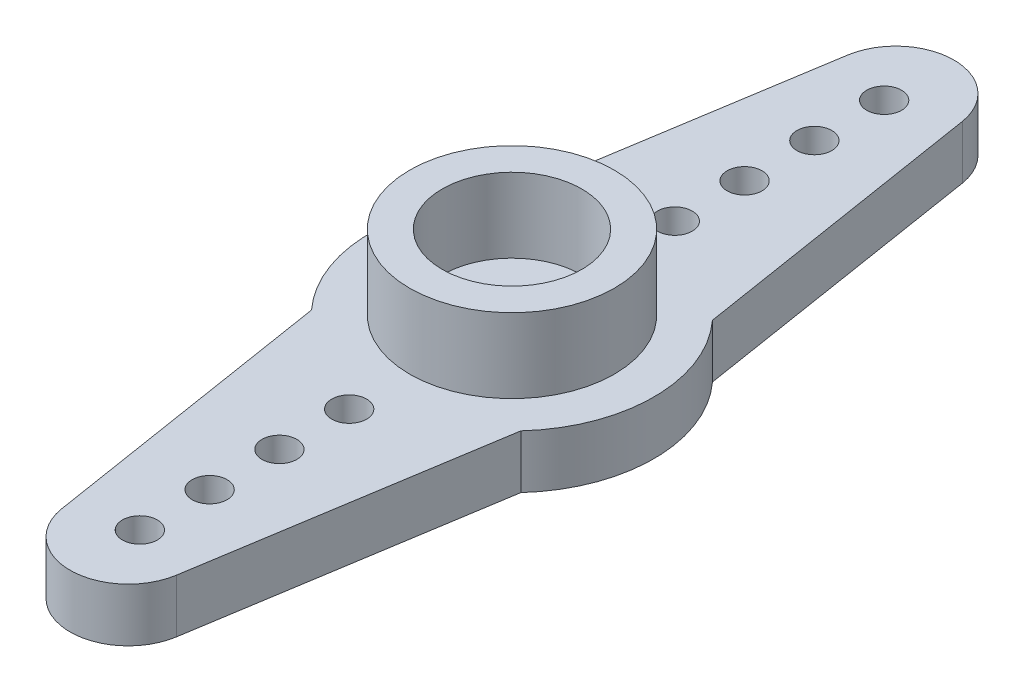
ISO-10303-21;
HEADER;
FILE_DESCRIPTION(('STEP AP214'),'2;1');
FILE_NAME('part.step','',(''),(''),'','','');
FILE_SCHEMA(('AUTOMOTIVE_DESIGN { 1 0 10303 214 1 1 1 1 }'));
ENDSEC;
DATA;
#1=APPLICATION_CONTEXT('core data for automotive mechanical design processes');
#2=APPLICATION_PROTOCOL_DEFINITION('international standard','automotive_design',2000,#1);
#3=PRODUCT_CONTEXT('',#1,'mechanical');
#4=PRODUCT('Part','Part','',(#3));
#5=PRODUCT_RELATED_PRODUCT_CATEGORY('part','',(#4));
#6=PRODUCT_DEFINITION_FORMATION('','',#4);
#7=PRODUCT_DEFINITION_CONTEXT('part definition',#1,'design');
#8=PRODUCT_DEFINITION('design','',#6,#7);
#9=PRODUCT_DEFINITION_SHAPE('','',#8);
#10=(LENGTH_UNIT() NAMED_UNIT(*) SI_UNIT(.MILLI.,.METRE.));
#11=(NAMED_UNIT(*) PLANE_ANGLE_UNIT() SI_UNIT($,.RADIAN.));
#12=(NAMED_UNIT(*) SI_UNIT($,.STERADIAN.) SOLID_ANGLE_UNIT());
#13=UNCERTAINTY_MEASURE_WITH_UNIT(LENGTH_MEASURE(1.E-05),#10,'distance_accuracy_value','');
#14=(GEOMETRIC_REPRESENTATION_CONTEXT(3) GLOBAL_UNCERTAINTY_ASSIGNED_CONTEXT((#13)) GLOBAL_UNIT_ASSIGNED_CONTEXT((#10,
#11,#12)) REPRESENTATION_CONTEXT('',''));
#15=CARTESIAN_POINT('',(0.,0.,0.));
#16=DIRECTION('',(0.,0.,1.));
#17=DIRECTION('',(1.,0.,0.));
#18=AXIS2_PLACEMENT_3D('',#15,#16,#17);
#19=CARTESIAN_POINT('',(0.,2.3,0.));
#20=DIRECTION('',(0.,-1.,0.));
#21=DIRECTION('',(0.,0.,-1.));
#22=AXIS2_PLACEMENT_3D('',#19,#20,#21);
#23=CYLINDRICAL_SURFACE('',#22,6.1);
#24=DIRECTION('',(0.,-1.,0.));
#25=VECTOR('',#24,1.);
#26=CARTESIAN_POINT('',(4.5,2.3,4.1182520563948));
#27=LINE('',#26,#25);
#28=CARTESIAN_POINT('',(4.5,2.3,4.1182520563948));
#29=VERTEX_POINT('',#28);
#30=CARTESIAN_POINT('',(4.5,0.,4.1182520563948));
#31=VERTEX_POINT('',#30);
#32=EDGE_CURVE('E123',#29,#31,#27,.T.);
#33=ORIENTED_EDGE('',*,*,#32,.T.);
#34=CARTESIAN_POINT('',(0.,0.,0.));
#35=DIRECTION('',(0.,1.,0.));
#36=DIRECTION('',(0.,0.,1.));
#37=AXIS2_PLACEMENT_3D('',#34,#35,#36);
#38=CIRCLE('',#37,6.1);
#39=CARTESIAN_POINT('',(4.5,0.,-4.1182520563948));
#40=VERTEX_POINT('',#39);
#41=EDGE_CURVE('E261',#31,#40,#38,.T.);
#42=ORIENTED_EDGE('',*,*,#41,.T.);
#43=DIRECTION('',(0.,-1.,0.));
#44=VECTOR('',#43,1.);
#45=CARTESIAN_POINT('',(4.5,2.3,-4.1182520563948));
#46=LINE('',#45,#44);
#47=CARTESIAN_POINT('',(4.5,2.3,-4.1182520563948));
#48=VERTEX_POINT('',#47);
#49=EDGE_CURVE('E231',#48,#40,#46,.T.);
#50=ORIENTED_EDGE('',*,*,#49,.F.);
#51=CARTESIAN_POINT('',(0.,2.3,0.));
#52=DIRECTION('',(0.,1.,0.));
#53=DIRECTION('',(0.,0.,1.));
#54=AXIS2_PLACEMENT_3D('',#51,#52,#53);
#55=CIRCLE('',#54,6.1);
#56=EDGE_CURVE('E59',#29,#48,#55,.T.);
#57=ORIENTED_EDGE('',*,*,#56,.F.);
#58=EDGE_LOOP('',(#33,#42,#50,#57));
#59=FACE_BOUND('',#58,.T.);
#60=ADVANCED_FACE('F41',(#59),#23,.T.);
#61=CARTESIAN_POINT('',(0.,2.3,0.));
#62=DIRECTION('',(0.,1.,0.));
#63=DIRECTION('',(0.,0.,1.));
#64=AXIS2_PLACEMENT_3D('',#61,#62,#63);
#65=PLANE('',#64);
#66=CARTESIAN_POINT('',(0.,2.3,0.));
#67=DIRECTION('',(0.,1.,0.));
#68=DIRECTION('',(0.,0.,1.));
#69=AXIS2_PLACEMENT_3D('',#66,#67,#68);
#70=CIRCLE('',#69,1.5);
#71=CARTESIAN_POINT('',(0.,2.3,1.5));
#72=VERTEX_POINT('',#71);
#73=EDGE_CURVE('E257',#72,#72,#70,.T.);
#74=ORIENTED_EDGE('',*,*,#73,.F.);
#75=EDGE_LOOP('',(#74));
#76=FACE_BOUND('',#75,.T.);
#77=CARTESIAN_POINT('',(0.,2.3,0.));
#78=DIRECTION('',(0.,1.,0.));
#79=DIRECTION('',(0.,0.,1.));
#80=AXIS2_PLACEMENT_3D('',#77,#78,#79);
#81=CIRCLE('',#80,3.);
#82=CARTESIAN_POINT('',(0.,2.3,3.));
#83=VERTEX_POINT('',#82);
#84=EDGE_CURVE('E235',#83,#83,#81,.T.);
#85=ORIENTED_EDGE('',*,*,#84,.T.);
#86=EDGE_LOOP('',(#85));
#87=FACE_BOUND('',#86,.T.);
#88=ADVANCED_FACE('F294',(#76,#87),#65,.T.);
#89=CARTESIAN_POINT('',(0.,2.3,0.));
#90=DIRECTION('',(0.,1.,0.));
#91=DIRECTION('',(0.,0.,1.));
#92=AXIS2_PLACEMENT_3D('',#89,#90,#91);
#93=CIRCLE('',#92,4.4);
#94=CARTESIAN_POINT('',(0.,2.3,4.4));
#95=VERTEX_POINT('',#94);
#96=EDGE_CURVE('E11',#95,#95,#93,.T.);
#97=ORIENTED_EDGE('',*,*,#96,.F.);
#98=EDGE_LOOP('',(#97));
#99=FACE_BOUND('',#98,.T.);
#100=CARTESIAN_POINT('',(-4.5,2.3,-4.1182520563948));
#101=VERTEX_POINT('',#100);
#102=CARTESIAN_POINT('',(-4.5,2.3,4.1182520563948));
#103=VERTEX_POINT('',#102);
#104=EDGE_CURVE('E51',#101,#103,#55,.T.);
#105=ORIENTED_EDGE('',*,*,#104,.T.);
#106=DIRECTION('',(-0.157019797021949,0.,-0.987595455307074));
#107=VECTOR('',#106,1.);
#108=CARTESIAN_POINT('',(-5.02767726414761,2.3,0.799360567392308));
#109=LINE('',#108,#107);
#110=CARTESIAN_POINT('',(-2.46898863826769,2.3,16.8925494925549));
#111=VERTEX_POINT('',#110);
#112=EDGE_CURVE('E135',#111,#103,#109,.T.);
#113=ORIENTED_EDGE('',*,*,#112,.F.);
#114=CARTESIAN_POINT('',(0.,2.3,16.5));
#115=DIRECTION('',(0.,-1.,0.));
#116=DIRECTION('',(0.,0.,1.));
#117=AXIS2_PLACEMENT_3D('',#114,#115,#116);
#118=CIRCLE('',#117,2.5);
#119=CARTESIAN_POINT('',(2.46898863826768,2.3,16.8925494925549));
#120=VERTEX_POINT('',#119);
#121=EDGE_CURVE('E114',#120,#111,#118,.T.);
#122=ORIENTED_EDGE('',*,*,#121,.F.);
#123=DIRECTION('',(0.15701979702195,0.,-0.987595455307073));
#124=VECTOR('',#123,1.);
#125=CARTESIAN_POINT('',(5.02767726414761,2.3,0.799360567392309));
#126=LINE('',#125,#124);
#127=EDGE_CURVE('E126',#120,#29,#126,.T.);
#128=ORIENTED_EDGE('',*,*,#127,.T.);
#129=ORIENTED_EDGE('',*,*,#56,.T.);
#130=DIRECTION('',(0.157019797021949,0.,0.987595455307074));
#131=VECTOR('',#130,1.);
#132=CARTESIAN_POINT('',(5.02767726414761,2.3,-0.799360567392308));
#133=LINE('',#132,#131);
#134=CARTESIAN_POINT('',(2.46898863826769,2.3,-16.8925494925549));
#135=VERTEX_POINT('',#134);
#136=EDGE_CURVE('E200',#135,#48,#133,.T.);
#137=ORIENTED_EDGE('',*,*,#136,.F.);
#138=CARTESIAN_POINT('',(0.,2.3,-16.5));
#139=DIRECTION('',(0.,-1.,0.));
#140=DIRECTION('',(0.,0.,-1.));
#141=AXIS2_PLACEMENT_3D('',#138,#139,#140);
#142=CIRCLE('',#141,2.5);
#143=CARTESIAN_POINT('',(-2.46898863826768,2.3,-16.8925494925549));
#144=VERTEX_POINT('',#143);
#145=EDGE_CURVE('E196',#144,#135,#142,.T.);
#146=ORIENTED_EDGE('',*,*,#145,.F.);
#147=DIRECTION('',(-0.15701979702195,0.,0.987595455307073));
#148=VECTOR('',#147,1.);
#149=CARTESIAN_POINT('',(-5.02767726414761,2.3,-0.799360567392309));
#150=LINE('',#149,#148);
#151=EDGE_CURVE('E192',#144,#101,#150,.T.);
#152=ORIENTED_EDGE('',*,*,#151,.T.);
#153=EDGE_LOOP('',(#105,#113,#122,#128,#129,#137,#146,#152));
#154=FACE_BOUND('',#153,.T.);
#155=CARTESIAN_POINT('',(0.,2.3,-7.));
#156=DIRECTION('',(0.,-1.,0.));
#157=DIRECTION('',(0.,0.,-1.));
#158=AXIS2_PLACEMENT_3D('',#155,#156,#157);
#159=CIRCLE('',#158,0.75);
#160=CARTESIAN_POINT('',(0.,2.3,-7.75));
#161=VERTEX_POINT('',#160);
#162=EDGE_CURVE('E175',#161,#161,#159,.T.);
#163=ORIENTED_EDGE('',*,*,#162,.T.);
#164=EDGE_LOOP('',(#163));
#165=FACE_BOUND('',#164,.T.);
#166=CARTESIAN_POINT('',(0.,2.3,-10.));
#167=DIRECTION('',(0.,-1.,0.));
#168=DIRECTION('',(0.,0.,-1.));
#169=AXIS2_PLACEMENT_3D('',#166,#167,#168);
#170=CIRCLE('',#169,0.750000000000001);
#171=CARTESIAN_POINT('',(0.,2.3,-10.75));
#172=VERTEX_POINT('',#171);
#173=EDGE_CURVE('E179',#172,#172,#170,.T.);
#174=ORIENTED_EDGE('',*,*,#173,.T.);
#175=EDGE_LOOP('',(#174));
#176=FACE_BOUND('',#175,.T.);
#177=CARTESIAN_POINT('',(0.,2.3,-13.));
#178=DIRECTION('',(0.,-1.,0.));
#179=DIRECTION('',(0.,0.,-1.));
#180=AXIS2_PLACEMENT_3D('',#177,#178,#179);
#181=CIRCLE('',#180,0.750000000000001);
#182=CARTESIAN_POINT('',(0.,2.3,-13.75));
#183=VERTEX_POINT('',#182);
#184=EDGE_CURVE('E184',#183,#183,#181,.T.);
#185=ORIENTED_EDGE('',*,*,#184,.T.);
#186=EDGE_LOOP('',(#185));
#187=FACE_BOUND('',#186,.T.);
#188=CARTESIAN_POINT('',(0.,2.3,-16.));
#189=DIRECTION('',(0.,-1.,0.));
#190=DIRECTION('',(0.,0.,-1.));
#191=AXIS2_PLACEMENT_3D('',#188,#189,#190);
#192=CIRCLE('',#191,0.75);
#193=CARTESIAN_POINT('',(0.,2.3,-16.75));
#194=VERTEX_POINT('',#193);
#195=EDGE_CURVE('E188',#194,#194,#192,.T.);
#196=ORIENTED_EDGE('',*,*,#195,.T.);
#197=EDGE_LOOP('',(#196));
#198=FACE_BOUND('',#197,.T.);
#199=CARTESIAN_POINT('',(0.,2.3,7.));
#200=DIRECTION('',(0.,-1.,0.));
#201=DIRECTION('',(0.,0.,1.));
#202=AXIS2_PLACEMENT_3D('',#199,#200,#201);
#203=CIRCLE('',#202,0.75);
#204=CARTESIAN_POINT('',(0.,2.3,7.75));
#205=VERTEX_POINT('',#204);
#206=EDGE_CURVE('E167',#205,#205,#203,.T.);
#207=ORIENTED_EDGE('',*,*,#206,.T.);
#208=EDGE_LOOP('',(#207));
#209=FACE_BOUND('',#208,.T.);
#210=CARTESIAN_POINT('',(0.,2.3,10.));
#211=DIRECTION('',(0.,-1.,0.));
#212=DIRECTION('',(0.,0.,1.));
#213=AXIS2_PLACEMENT_3D('',#210,#211,#212);
#214=CIRCLE('',#213,0.750000000000001);
#215=CARTESIAN_POINT('',(0.,2.3,10.75));
#216=VERTEX_POINT('',#215);
#217=EDGE_CURVE('E530',#216,#216,#214,.T.);
#218=ORIENTED_EDGE('',*,*,#217,.T.);
#219=EDGE_LOOP('',(#218));
#220=FACE_BOUND('',#219,.T.);
#221=CARTESIAN_POINT('',(0.,2.3,13.));
#222=DIRECTION('',(0.,-1.,0.));
#223=DIRECTION('',(0.,0.,1.));
#224=AXIS2_PLACEMENT_3D('',#221,#222,#223);
#225=CIRCLE('',#224,0.750000000000001);
#226=CARTESIAN_POINT('',(0.,2.3,13.75));
#227=VERTEX_POINT('',#226);
#228=EDGE_CURVE('E527',#227,#227,#225,.T.);
#229=ORIENTED_EDGE('',*,*,#228,.T.);
#230=EDGE_LOOP('',(#229));
#231=FACE_BOUND('',#230,.T.);
#232=CARTESIAN_POINT('',(0.,2.3,16.));
#233=DIRECTION('',(0.,-1.,0.));
#234=DIRECTION('',(0.,0.,1.));
#235=AXIS2_PLACEMENT_3D('',#232,#233,#234);
#236=CIRCLE('',#235,0.75);
#237=CARTESIAN_POINT('',(0.,2.3,16.75));
#238=VERTEX_POINT('',#237);
#239=EDGE_CURVE('E130',#238,#238,#236,.T.);
#240=ORIENTED_EDGE('',*,*,#239,.T.);
#241=EDGE_LOOP('',(#240));
#242=FACE_BOUND('',#241,.T.);
#243=ADVANCED_FACE('F132',(#99,#154,#165,#176,#187,#198,#209,#220,#231,#242),#65,.T.);
#244=CARTESIAN_POINT('',(0.,0.,0.));
#245=DIRECTION('',(0.,1.,0.));
#246=DIRECTION('',(0.,0.,1.));
#247=AXIS2_PLACEMENT_3D('',#244,#245,#246);
#248=PLANE('',#247);
#249=CARTESIAN_POINT('',(-4.5,0.,-4.1182520563948));
#250=VERTEX_POINT('',#249);
#251=CARTESIAN_POINT('',(-4.5,0.,4.1182520563948));
#252=VERTEX_POINT('',#251);
#253=EDGE_CURVE('E45',#250,#252,#38,.T.);
#254=ORIENTED_EDGE('',*,*,#253,.F.);
#255=DIRECTION('',(-0.15701979702195,0.,0.987595455307073));
#256=VECTOR('',#255,1.);
#257=CARTESIAN_POINT('',(-5.02767726414761,0.,-0.799360567392309));
#258=LINE('',#257,#256);
#259=CARTESIAN_POINT('',(-2.46898863826768,0.,-16.8925494925549));
#260=VERTEX_POINT('',#259);
#261=EDGE_CURVE('E220',#260,#250,#258,.T.);
#262=ORIENTED_EDGE('',*,*,#261,.F.);
#263=CARTESIAN_POINT('',(0.,0.,-16.5));
#264=DIRECTION('',(0.,-1.,0.));
#265=DIRECTION('',(0.,0.,-1.));
#266=AXIS2_PLACEMENT_3D('',#263,#264,#265);
#267=CIRCLE('',#266,2.5);
#268=CARTESIAN_POINT('',(2.46898863826769,0.,-16.8925494925549));
#269=VERTEX_POINT('',#268);
#270=EDGE_CURVE('E224',#260,#269,#267,.T.);
#271=ORIENTED_EDGE('',*,*,#270,.T.);
#272=DIRECTION('',(0.157019797021949,0.,0.987595455307074));
#273=VECTOR('',#272,1.);
#274=CARTESIAN_POINT('',(5.02767726414761,0.,-0.799360567392308));
#275=LINE('',#274,#273);
#276=EDGE_CURVE('E180',#269,#40,#275,.T.);
#277=ORIENTED_EDGE('',*,*,#276,.T.);
#278=ORIENTED_EDGE('',*,*,#41,.F.);
#279=DIRECTION('',(0.15701979702195,0.,-0.987595455307073));
#280=VECTOR('',#279,1.);
#281=CARTESIAN_POINT('',(5.02767726414761,0.,0.799360567392309));
#282=LINE('',#281,#280);
#283=CARTESIAN_POINT('',(2.46898863826768,0.,16.8925494925549));
#284=VERTEX_POINT('',#283);
#285=EDGE_CURVE('E158',#284,#31,#282,.T.);
#286=ORIENTED_EDGE('',*,*,#285,.F.);
#287=CARTESIAN_POINT('',(0.,0.,16.5));
#288=DIRECTION('',(0.,-1.,0.));
#289=DIRECTION('',(0.,0.,1.));
#290=AXIS2_PLACEMENT_3D('',#287,#288,#289);
#291=CIRCLE('',#290,2.5);
#292=CARTESIAN_POINT('',(-2.46898863826769,0.,16.8925494925549));
#293=VERTEX_POINT('',#292);
#294=EDGE_CURVE('E117',#284,#293,#291,.T.);
#295=ORIENTED_EDGE('',*,*,#294,.T.);
#296=DIRECTION('',(-0.157019797021949,0.,-0.987595455307074));
#297=VECTOR('',#296,1.);
#298=CARTESIAN_POINT('',(-5.02767726414761,0.,0.799360567392308));
#299=LINE('',#298,#297);
#300=EDGE_CURVE('E163',#293,#252,#299,.T.);
#301=ORIENTED_EDGE('',*,*,#300,.T.);
#302=EDGE_LOOP('',(#254,#262,#271,#277,#278,#286,#295,#301));
#303=FACE_BOUND('',#302,.T.);
#304=CARTESIAN_POINT('',(0.,0.,0.));
#305=DIRECTION('',(0.,1.,0.));
#306=DIRECTION('',(0.,0.,1.));
#307=AXIS2_PLACEMENT_3D('',#304,#305,#306);
#308=CIRCLE('',#307,1.5);
#309=CARTESIAN_POINT('',(0.,0.,1.5));
#310=VERTEX_POINT('',#309);
#311=EDGE_CURVE('E255',#310,#310,#308,.T.);
#312=ORIENTED_EDGE('',*,*,#311,.T.);
#313=EDGE_LOOP('',(#312));
#314=FACE_BOUND('',#313,.T.);
#315=CARTESIAN_POINT('',(0.,0.,-7.));
#316=DIRECTION('',(0.,-1.,0.));
#317=DIRECTION('',(0.,0.,-1.));
#318=AXIS2_PLACEMENT_3D('',#315,#316,#317);
#319=CIRCLE('',#318,0.75);
#320=CARTESIAN_POINT('',(0.,0.,-7.75));
#321=VERTEX_POINT('',#320);
#322=EDGE_CURVE('E170',#321,#321,#319,.T.);
#323=ORIENTED_EDGE('',*,*,#322,.F.);
#324=EDGE_LOOP('',(#323));
#325=FACE_BOUND('',#324,.T.);
#326=CARTESIAN_POINT('',(0.,0.,-10.));
#327=DIRECTION('',(0.,-1.,0.));
#328=DIRECTION('',(0.,0.,-1.));
#329=AXIS2_PLACEMENT_3D('',#326,#327,#328);
#330=CIRCLE('',#329,0.750000000000001);
#331=CARTESIAN_POINT('',(0.,0.,-10.75));
#332=VERTEX_POINT('',#331);
#333=EDGE_CURVE('E208',#332,#332,#330,.T.);
#334=ORIENTED_EDGE('',*,*,#333,.F.);
#335=EDGE_LOOP('',(#334));
#336=FACE_BOUND('',#335,.T.);
#337=CARTESIAN_POINT('',(0.,0.,-13.));
#338=DIRECTION('',(0.,-1.,0.));
#339=DIRECTION('',(0.,0.,-1.));
#340=AXIS2_PLACEMENT_3D('',#337,#338,#339);
#341=CIRCLE('',#340,0.750000000000001);
#342=CARTESIAN_POINT('',(0.,0.,-13.75));
#343=VERTEX_POINT('',#342);
#344=EDGE_CURVE('E212',#343,#343,#341,.T.);
#345=ORIENTED_EDGE('',*,*,#344,.F.);
#346=EDGE_LOOP('',(#345));
#347=FACE_BOUND('',#346,.T.);
#348=CARTESIAN_POINT('',(0.,0.,-16.));
#349=DIRECTION('',(0.,-1.,0.));
#350=DIRECTION('',(0.,0.,-1.));
#351=AXIS2_PLACEMENT_3D('',#348,#349,#350);
#352=CIRCLE('',#351,0.75);
#353=CARTESIAN_POINT('',(0.,0.,-16.75));
#354=VERTEX_POINT('',#353);
#355=EDGE_CURVE('E216',#354,#354,#352,.T.);
#356=ORIENTED_EDGE('',*,*,#355,.F.);
#357=EDGE_LOOP('',(#356));
#358=FACE_BOUND('',#357,.T.);
#359=CARTESIAN_POINT('',(0.,0.,7.));
#360=DIRECTION('',(0.,-1.,0.));
#361=DIRECTION('',(0.,0.,1.));
#362=AXIS2_PLACEMENT_3D('',#359,#360,#361);
#363=CIRCLE('',#362,0.75);
#364=CARTESIAN_POINT('',(0.,0.,7.75));
#365=VERTEX_POINT('',#364);
#366=EDGE_CURVE('E142',#365,#365,#363,.T.);
#367=ORIENTED_EDGE('',*,*,#366,.F.);
#368=EDGE_LOOP('',(#367));
#369=FACE_BOUND('',#368,.T.);
#370=CARTESIAN_POINT('',(0.,0.,10.));
#371=DIRECTION('',(0.,-1.,0.));
#372=DIRECTION('',(0.,0.,1.));
#373=AXIS2_PLACEMENT_3D('',#370,#371,#372);
#374=CIRCLE('',#373,0.750000000000001);
#375=CARTESIAN_POINT('',(0.,0.,10.75));
#376=VERTEX_POINT('',#375);
#377=EDGE_CURVE('E146',#376,#376,#374,.T.);
#378=ORIENTED_EDGE('',*,*,#377,.F.);
#379=EDGE_LOOP('',(#378));
#380=FACE_BOUND('',#379,.T.);
#381=CARTESIAN_POINT('',(0.,0.,13.));
#382=DIRECTION('',(0.,-1.,0.));
#383=DIRECTION('',(0.,0.,1.));
#384=AXIS2_PLACEMENT_3D('',#381,#382,#383);
#385=CIRCLE('',#384,0.750000000000001);
#386=CARTESIAN_POINT('',(0.,0.,13.75));
#387=VERTEX_POINT('',#386);
#388=EDGE_CURVE('E150',#387,#387,#385,.T.);
#389=ORIENTED_EDGE('',*,*,#388,.F.);
#390=EDGE_LOOP('',(#389));
#391=FACE_BOUND('',#390,.T.);
#392=CARTESIAN_POINT('',(0.,0.,16.));
#393=DIRECTION('',(0.,-1.,0.));
#394=DIRECTION('',(0.,0.,1.));
#395=AXIS2_PLACEMENT_3D('',#392,#393,#394);
#396=CIRCLE('',#395,0.75);
#397=CARTESIAN_POINT('',(0.,0.,16.75));
#398=VERTEX_POINT('',#397);
#399=EDGE_CURVE('E154',#398,#398,#396,.T.);
#400=ORIENTED_EDGE('',*,*,#399,.F.);
#401=EDGE_LOOP('',(#400));
#402=FACE_BOUND('',#401,.T.);
#403=ADVANCED_FACE('F273',(#303,#314,#325,#336,#347,#358,#369,#380,#391,#402),#248,.F.);
#404=ORIENTED_EDGE('',*,*,#253,.T.);
#405=DIRECTION('',(0.,-1.,0.));
#406=VECTOR('',#405,1.);
#407=CARTESIAN_POINT('',(-4.5,2.3,4.1182520563948));
#408=LINE('',#407,#406);
#409=EDGE_CURVE('E67',#103,#252,#408,.T.);
#410=ORIENTED_EDGE('',*,*,#409,.F.);
#411=ORIENTED_EDGE('',*,*,#104,.F.);
#412=DIRECTION('',(0.,-1.,0.));
#413=VECTOR('',#412,1.);
#414=CARTESIAN_POINT('',(-4.5,2.3,-4.1182520563948));
#415=LINE('',#414,#413);
#416=EDGE_CURVE('E204',#101,#250,#415,.T.);
#417=ORIENTED_EDGE('',*,*,#416,.T.);
#418=EDGE_LOOP('',(#404,#410,#411,#417));
#419=FACE_BOUND('',#418,.T.);
#420=ADVANCED_FACE('F43',(#419),#23,.T.);
#421=CARTESIAN_POINT('',(0.,2.3,0.));
#422=DIRECTION('',(0.,-1.,0.));
#423=DIRECTION('',(0.,0.,-1.));
#424=AXIS2_PLACEMENT_3D('',#421,#422,#423);
#425=CYLINDRICAL_SURFACE('',#424,1.5);
#426=ORIENTED_EDGE('',*,*,#73,.T.);
#427=EDGE_LOOP('',(#426));
#428=FACE_BOUND('',#427,.T.);
#429=ORIENTED_EDGE('',*,*,#311,.F.);
#430=EDGE_LOOP('',(#429));
#431=FACE_BOUND('',#430,.T.);
#432=ADVANCED_FACE('F285',(#428,#431),#425,.F.);
#433=CARTESIAN_POINT('',(0.,5.5,0.));
#434=DIRECTION('',(0.,1.,0.));
#435=DIRECTION('',(0.,0.,1.));
#436=AXIS2_PLACEMENT_3D('',#433,#434,#435);
#437=PLANE('',#436);
#438=CARTESIAN_POINT('',(0.,5.5,0.));
#439=DIRECTION('',(0.,1.,0.));
#440=DIRECTION('',(0.,0.,1.));
#441=AXIS2_PLACEMENT_3D('',#438,#439,#440);
#442=CIRCLE('',#441,4.4);
#443=CARTESIAN_POINT('',(0.,5.5,4.4));
#444=VERTEX_POINT('',#443);
#445=EDGE_CURVE('E249',#444,#444,#442,.T.);
#446=ORIENTED_EDGE('',*,*,#445,.T.);
#447=EDGE_LOOP('',(#446));
#448=FACE_BOUND('',#447,.T.);
#449=CARTESIAN_POINT('',(0.,5.5,0.));
#450=DIRECTION('',(0.,1.,0.));
#451=DIRECTION('',(0.,0.,1.));
#452=AXIS2_PLACEMENT_3D('',#449,#450,#451);
#453=CIRCLE('',#452,3.);
#454=CARTESIAN_POINT('',(0.,5.5,3.));
#455=VERTEX_POINT('',#454);
#456=EDGE_CURVE('E245',#455,#455,#453,.T.);
#457=ORIENTED_EDGE('',*,*,#456,.F.);
#458=EDGE_LOOP('',(#457));
#459=FACE_BOUND('',#458,.T.);
#460=ADVANCED_FACE('F290',(#448,#459),#437,.T.);
#461=CARTESIAN_POINT('',(0.,5.5,0.));
#462=DIRECTION('',(0.,-1.,0.));
#463=DIRECTION('',(0.,0.,-1.));
#464=AXIS2_PLACEMENT_3D('',#461,#462,#463);
#465=CYLINDRICAL_SURFACE('',#464,4.4);
#466=ORIENTED_EDGE('',*,*,#445,.F.);
#467=EDGE_LOOP('',(#466));
#468=FACE_BOUND('',#467,.T.);
#469=ORIENTED_EDGE('',*,*,#96,.T.);
#470=EDGE_LOOP('',(#469));
#471=FACE_BOUND('',#470,.T.);
#472=ADVANCED_FACE('F307',(#468,#471),#465,.T.);
#473=CARTESIAN_POINT('',(0.,5.5,0.));
#474=DIRECTION('',(0.,-1.,0.));
#475=DIRECTION('',(0.,0.,-1.));
#476=AXIS2_PLACEMENT_3D('',#473,#474,#475);
#477=CYLINDRICAL_SURFACE('',#476,3.);
#478=ORIENTED_EDGE('',*,*,#456,.T.);
#479=EDGE_LOOP('',(#478));
#480=FACE_BOUND('',#479,.T.);
#481=ORIENTED_EDGE('',*,*,#84,.F.);
#482=EDGE_LOOP('',(#481));
#483=FACE_BOUND('',#482,.T.);
#484=ADVANCED_FACE('F310',(#480,#483),#477,.F.);
#485=CARTESIAN_POINT('',(5.02767726414761,2.3,-0.799360567392308));
#486=DIRECTION('',(0.987595455307073,0.,-0.157019797021949));
#487=DIRECTION('',(-0.157019797021949,0.,-0.987595455307074));
#488=AXIS2_PLACEMENT_3D('',#485,#486,#487);
#489=PLANE('',#488);
#490=ORIENTED_EDGE('',*,*,#276,.F.);
#491=DIRECTION('',(0.,-1.,0.));
#492=VECTOR('',#491,1.);
#493=CARTESIAN_POINT('',(2.46898863826769,2.3,-16.8925494925549));
#494=LINE('',#493,#492);
#495=EDGE_CURVE('E236',#135,#269,#494,.T.);
#496=ORIENTED_EDGE('',*,*,#495,.F.);
#497=ORIENTED_EDGE('',*,*,#136,.T.);
#498=ORIENTED_EDGE('',*,*,#49,.T.);
#499=EDGE_LOOP('',(#490,#496,#497,#498));
#500=FACE_BOUND('',#499,.T.);
#501=ADVANCED_FACE('F272',(#500),#489,.T.);
#502=CARTESIAN_POINT('',(0.,2.3,-16.5));
#503=DIRECTION('',(0.,-1.,0.));
#504=DIRECTION('',(0.,0.,-1.));
#505=AXIS2_PLACEMENT_3D('',#502,#503,#504);
#506=CYLINDRICAL_SURFACE('',#505,2.5);
#507=ORIENTED_EDGE('',*,*,#270,.F.);
#508=DIRECTION('',(0.,-1.,0.));
#509=VECTOR('',#508,1.);
#510=CARTESIAN_POINT('',(-2.46898863826768,2.3,-16.8925494925549));
#511=LINE('',#510,#509);
#512=EDGE_CURVE('E239',#144,#260,#511,.T.);
#513=ORIENTED_EDGE('',*,*,#512,.F.);
#514=ORIENTED_EDGE('',*,*,#145,.T.);
#515=ORIENTED_EDGE('',*,*,#495,.T.);
#516=EDGE_LOOP('',(#507,#513,#514,#515));
#517=FACE_BOUND('',#516,.T.);
#518=ADVANCED_FACE('F278',(#517),#506,.T.);
#519=CARTESIAN_POINT('',(0.,2.3,-16.));
#520=DIRECTION('',(0.,-1.,0.));
#521=DIRECTION('',(0.,0.,-1.));
#522=AXIS2_PLACEMENT_3D('',#519,#520,#521);
#523=CYLINDRICAL_SURFACE('',#522,0.75);
#524=ORIENTED_EDGE('',*,*,#195,.F.);
#525=EDGE_LOOP('',(#524));
#526=FACE_BOUND('',#525,.T.);
#527=ORIENTED_EDGE('',*,*,#355,.T.);
#528=EDGE_LOOP('',(#527));
#529=FACE_BOUND('',#528,.T.);
#530=ADVANCED_FACE('F329',(#526,#529),#523,.F.);
#531=CARTESIAN_POINT('',(0.,2.3,-13.));
#532=DIRECTION('',(0.,-1.,0.));
#533=DIRECTION('',(0.,0.,-1.));
#534=AXIS2_PLACEMENT_3D('',#531,#532,#533);
#535=CYLINDRICAL_SURFACE('',#534,0.750000000000001);
#536=ORIENTED_EDGE('',*,*,#184,.F.);
#537=EDGE_LOOP('',(#536));
#538=FACE_BOUND('',#537,.T.);
#539=ORIENTED_EDGE('',*,*,#344,.T.);
#540=EDGE_LOOP('',(#539));
#541=FACE_BOUND('',#540,.T.);
#542=ADVANCED_FACE('F325',(#538,#541),#535,.F.);
#543=CARTESIAN_POINT('',(0.,2.3,-10.));
#544=DIRECTION('',(0.,-1.,0.));
#545=DIRECTION('',(0.,0.,-1.));
#546=AXIS2_PLACEMENT_3D('',#543,#544,#545);
#547=CYLINDRICAL_SURFACE('',#546,0.750000000000001);
#548=ORIENTED_EDGE('',*,*,#173,.F.);
#549=EDGE_LOOP('',(#548));
#550=FACE_BOUND('',#549,.T.);
#551=ORIENTED_EDGE('',*,*,#333,.T.);
#552=EDGE_LOOP('',(#551));
#553=FACE_BOUND('',#552,.T.);
#554=ADVANCED_FACE('F321',(#550,#553),#547,.F.);
#555=CARTESIAN_POINT('',(0.,2.3,-7.));
#556=DIRECTION('',(0.,-1.,0.));
#557=DIRECTION('',(0.,0.,-1.));
#558=AXIS2_PLACEMENT_3D('',#555,#556,#557);
#559=CYLINDRICAL_SURFACE('',#558,0.75);
#560=ORIENTED_EDGE('',*,*,#162,.F.);
#561=EDGE_LOOP('',(#560));
#562=FACE_BOUND('',#561,.T.);
#563=ORIENTED_EDGE('',*,*,#322,.T.);
#564=EDGE_LOOP('',(#563));
#565=FACE_BOUND('',#564,.T.);
#566=ADVANCED_FACE('F318',(#562,#565),#559,.F.);
#567=CARTESIAN_POINT('',(-5.02767726414761,2.3,-0.799360567392309));
#568=DIRECTION('',(0.987595455307073,0.,0.15701979702195));
#569=DIRECTION('',(0.15701979702195,0.,-0.987595455307073));
#570=AXIS2_PLACEMENT_3D('',#567,#568,#569);
#571=PLANE('',#570);
#572=ORIENTED_EDGE('',*,*,#261,.T.);
#573=ORIENTED_EDGE('',*,*,#416,.F.);
#574=ORIENTED_EDGE('',*,*,#151,.F.);
#575=ORIENTED_EDGE('',*,*,#512,.T.);
#576=EDGE_LOOP('',(#572,#573,#574,#575));
#577=FACE_BOUND('',#576,.T.);
#578=ADVANCED_FACE('F283',(#577),#571,.F.);
#579=CARTESIAN_POINT('',(-5.02767726414761,2.3,0.799360567392308));
#580=DIRECTION('',(-0.987595455307073,0.,0.157019797021949));
#581=DIRECTION('',(0.157019797021949,0.,0.987595455307074));
#582=AXIS2_PLACEMENT_3D('',#579,#580,#581);
#583=PLANE('',#582);
#584=ORIENTED_EDGE('',*,*,#300,.F.);
#585=DIRECTION('',(0.,-1.,0.));
#586=VECTOR('',#585,1.);
#587=CARTESIAN_POINT('',(-2.46898863826769,2.3,16.8925494925549));
#588=LINE('',#587,#586);
#589=EDGE_CURVE('E122',#111,#293,#588,.T.);
#590=ORIENTED_EDGE('',*,*,#589,.F.);
#591=ORIENTED_EDGE('',*,*,#112,.T.);
#592=ORIENTED_EDGE('',*,*,#409,.T.);
#593=EDGE_LOOP('',(#584,#590,#591,#592));
#594=FACE_BOUND('',#593,.T.);
#595=ADVANCED_FACE('F336',(#594),#583,.T.);
#596=CARTESIAN_POINT('',(0.,2.3,16.5));
#597=DIRECTION('',(0.,-1.,0.));
#598=DIRECTION('',(0.,0.,-1.));
#599=AXIS2_PLACEMENT_3D('',#596,#597,#598);
#600=CYLINDRICAL_SURFACE('',#599,2.5);
#601=ORIENTED_EDGE('',*,*,#294,.F.);
#602=DIRECTION('',(0.,-1.,0.));
#603=VECTOR('',#602,1.);
#604=CARTESIAN_POINT('',(2.46898863826768,2.3,16.8925494925549));
#605=LINE('',#604,#603);
#606=EDGE_CURVE('E110',#120,#284,#605,.T.);
#607=ORIENTED_EDGE('',*,*,#606,.F.);
#608=ORIENTED_EDGE('',*,*,#121,.T.);
#609=ORIENTED_EDGE('',*,*,#589,.T.);
#610=EDGE_LOOP('',(#601,#607,#608,#609));
#611=FACE_BOUND('',#610,.T.);
#612=ADVANCED_FACE('F112',(#611),#600,.T.);
#613=CARTESIAN_POINT('',(0.,2.3,16.));
#614=DIRECTION('',(0.,-1.,0.));
#615=DIRECTION('',(0.,0.,-1.));
#616=AXIS2_PLACEMENT_3D('',#613,#614,#615);
#617=CYLINDRICAL_SURFACE('',#616,0.75);
#618=ORIENTED_EDGE('',*,*,#239,.F.);
#619=EDGE_LOOP('',(#618));
#620=FACE_BOUND('',#619,.T.);
#621=ORIENTED_EDGE('',*,*,#399,.T.);
#622=EDGE_LOOP('',(#621));
#623=FACE_BOUND('',#622,.T.);
#624=ADVANCED_FACE('F352',(#620,#623),#617,.F.);
#625=CARTESIAN_POINT('',(0.,2.3,13.));
#626=DIRECTION('',(0.,-1.,0.));
#627=DIRECTION('',(0.,0.,-1.));
#628=AXIS2_PLACEMENT_3D('',#625,#626,#627);
#629=CYLINDRICAL_SURFACE('',#628,0.750000000000001);
#630=ORIENTED_EDGE('',*,*,#228,.F.);
#631=EDGE_LOOP('',(#630));
#632=FACE_BOUND('',#631,.T.);
#633=ORIENTED_EDGE('',*,*,#388,.T.);
#634=EDGE_LOOP('',(#633));
#635=FACE_BOUND('',#634,.T.);
#636=ADVANCED_FACE('F348',(#632,#635),#629,.F.);
#637=CARTESIAN_POINT('',(0.,2.3,10.));
#638=DIRECTION('',(0.,-1.,0.));
#639=DIRECTION('',(0.,0.,-1.));
#640=AXIS2_PLACEMENT_3D('',#637,#638,#639);
#641=CYLINDRICAL_SURFACE('',#640,0.750000000000001);
#642=ORIENTED_EDGE('',*,*,#217,.F.);
#643=EDGE_LOOP('',(#642));
#644=FACE_BOUND('',#643,.T.);
#645=ORIENTED_EDGE('',*,*,#377,.T.);
#646=EDGE_LOOP('',(#645));
#647=FACE_BOUND('',#646,.T.);
#648=ADVANCED_FACE('F344',(#644,#647),#641,.F.);
#649=CARTESIAN_POINT('',(0.,2.3,7.));
#650=DIRECTION('',(0.,-1.,0.));
#651=DIRECTION('',(0.,0.,-1.));
#652=AXIS2_PLACEMENT_3D('',#649,#650,#651);
#653=CYLINDRICAL_SURFACE('',#652,0.75);
#654=ORIENTED_EDGE('',*,*,#206,.F.);
#655=EDGE_LOOP('',(#654));
#656=FACE_BOUND('',#655,.T.);
#657=ORIENTED_EDGE('',*,*,#366,.T.);
#658=EDGE_LOOP('',(#657));
#659=FACE_BOUND('',#658,.T.);
#660=ADVANCED_FACE('F341',(#656,#659),#653,.F.);
#661=CARTESIAN_POINT('',(5.02767726414761,2.3,0.799360567392309));
#662=DIRECTION('',(-0.987595455307073,0.,-0.15701979702195));
#663=DIRECTION('',(-0.15701979702195,0.,0.987595455307073));
#664=AXIS2_PLACEMENT_3D('',#661,#662,#663);
#665=PLANE('',#664);
#666=ORIENTED_EDGE('',*,*,#285,.T.);
#667=ORIENTED_EDGE('',*,*,#32,.F.);
#668=ORIENTED_EDGE('',*,*,#127,.F.);
#669=ORIENTED_EDGE('',*,*,#606,.T.);
#670=EDGE_LOOP('',(#666,#667,#668,#669));
#671=FACE_BOUND('',#670,.T.);
#672=ADVANCED_FACE('F127',(#671),#665,.F.);
#673=CLOSED_SHELL('',(#60,#88,#243,#403,#420,#432,#460,#472,#484,#501,#518,#530,#542,#554,#566,
#578,#595,#612,#624,#636,#648,#660,#672));
#674=MANIFOLD_SOLID_BREP('B2',#673);
#675=ADVANCED_BREP_SHAPE_REPRESENTATION('',(#18,#674),#14);
#676=SHAPE_DEFINITION_REPRESENTATION(#9,#675);
ENDSEC;
END-ISO-10303-21;
